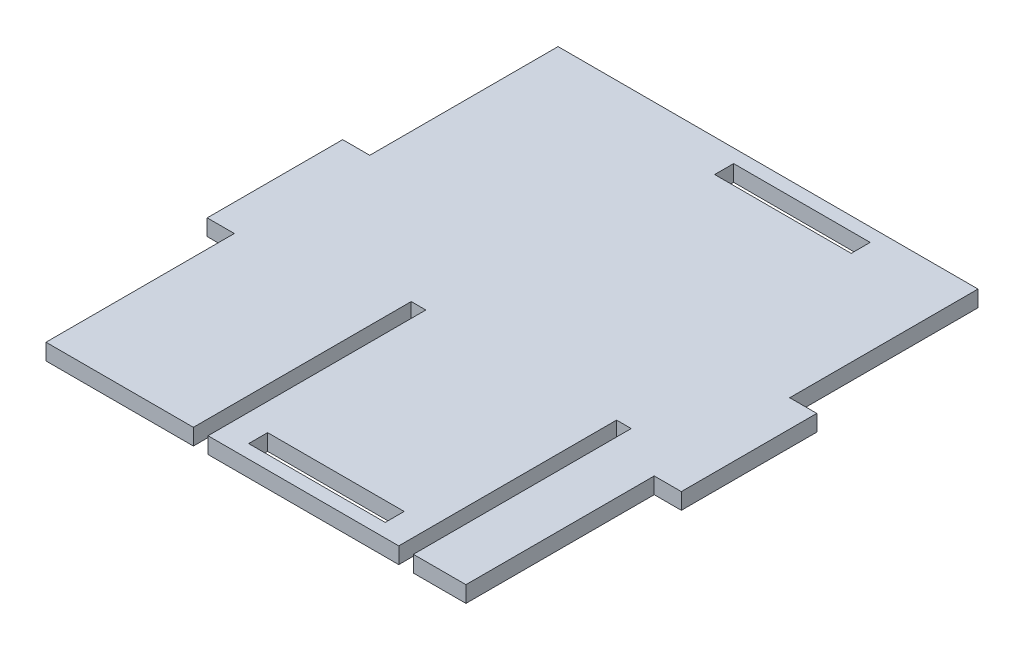
ISO-10303-21;
HEADER;
FILE_DESCRIPTION(('STEP AP214'),'2;1');
FILE_NAME('part.step','',(''),(''),'','','');
FILE_SCHEMA(('AUTOMOTIVE_DESIGN { 1 0 10303 214 1 1 1 1 }'));
ENDSEC;
DATA;
#1=APPLICATION_CONTEXT('core data for automotive mechanical design processes');
#2=APPLICATION_PROTOCOL_DEFINITION('international standard','automotive_design',2000,#1);
#3=PRODUCT_CONTEXT('',#1,'mechanical');
#4=PRODUCT('Part','Part','',(#3));
#5=PRODUCT_RELATED_PRODUCT_CATEGORY('part','',(#4));
#6=PRODUCT_DEFINITION_FORMATION('','',#4);
#7=PRODUCT_DEFINITION_CONTEXT('part definition',#1,'design');
#8=PRODUCT_DEFINITION('design','',#6,#7);
#9=PRODUCT_DEFINITION_SHAPE('','',#8);
#10=(LENGTH_UNIT() NAMED_UNIT(*) SI_UNIT(.MILLI.,.METRE.));
#11=(NAMED_UNIT(*) PLANE_ANGLE_UNIT() SI_UNIT($,.RADIAN.));
#12=(NAMED_UNIT(*) SI_UNIT($,.STERADIAN.) SOLID_ANGLE_UNIT());
#13=UNCERTAINTY_MEASURE_WITH_UNIT(LENGTH_MEASURE(1.E-05),#10,'distance_accuracy_value','');
#14=(GEOMETRIC_REPRESENTATION_CONTEXT(3) GLOBAL_UNCERTAINTY_ASSIGNED_CONTEXT((#13)) GLOBAL_UNIT_ASSIGNED_CONTEXT((#10,
#11,#12)) REPRESENTATION_CONTEXT('',''));
#15=CARTESIAN_POINT('',(0.,0.,0.));
#16=DIRECTION('',(0.,0.,1.));
#17=DIRECTION('',(1.,0.,0.));
#18=AXIS2_PLACEMENT_3D('',#15,#16,#17);
#19=CARTESIAN_POINT('',(-19.4,6.,0.));
#20=DIRECTION('',(-1.,0.,0.));
#21=DIRECTION('',(0.,0.,1.));
#22=AXIS2_PLACEMENT_3D('',#19,#20,#21);
#23=PLANE('',#22);
#24=DIRECTION('',(0.,0.,-1.));
#25=VECTOR('',#24,1.);
#26=CARTESIAN_POINT('',(-19.4,0.,0.));
#27=LINE('',#26,#25);
#28=CARTESIAN_POINT('',(-19.4,0.,0.));
#29=VERTEX_POINT('',#28);
#30=CARTESIAN_POINT('',(-19.4,0.,-80.4));
#31=VERTEX_POINT('',#30);
#32=EDGE_CURVE('E449',#29,#31,#27,.T.);
#33=ORIENTED_EDGE('',*,*,#32,.F.);
#34=DIRECTION('',(0.,-1.,0.));
#35=VECTOR('',#34,1.);
#36=CARTESIAN_POINT('',(-19.4,6.,0.));
#37=LINE('',#36,#35);
#38=CARTESIAN_POINT('',(-19.4,6.,0.));
#39=VERTEX_POINT('',#38);
#40=EDGE_CURVE('E11',#39,#29,#37,.T.);
#41=ORIENTED_EDGE('',*,*,#40,.F.);
#42=DIRECTION('',(0.,0.,-1.));
#43=VECTOR('',#42,1.);
#44=CARTESIAN_POINT('',(-19.4,6.,0.));
#45=LINE('',#44,#43);
#46=CARTESIAN_POINT('',(-19.4,6.,-80.4));
#47=VERTEX_POINT('',#46);
#48=EDGE_CURVE('E283',#39,#47,#45,.T.);
#49=ORIENTED_EDGE('',*,*,#48,.T.);
#50=DIRECTION('',(0.,-1.,0.));
#51=VECTOR('',#50,1.);
#52=CARTESIAN_POINT('',(-19.4,6.,-80.4));
#53=LINE('',#52,#51);
#54=EDGE_CURVE('E162',#47,#31,#53,.T.);
#55=ORIENTED_EDGE('',*,*,#54,.T.);
#56=EDGE_LOOP('',(#33,#41,#49,#55));
#57=FACE_BOUND('',#56,.T.);
#58=ADVANCED_FACE('F47',(#57),#23,.T.);
#59=CARTESIAN_POINT('',(0.,6.,0.));
#60=DIRECTION('',(0.,0.,1.));
#61=DIRECTION('',(1.,0.,0.));
#62=AXIS2_PLACEMENT_3D('',#59,#60,#61);
#63=PLANE('',#62);
#64=DIRECTION('',(-1.,0.,0.));
#65=VECTOR('',#64,1.);
#66=CARTESIAN_POINT('',(0.,0.,0.));
#67=LINE('',#66,#65);
#68=CARTESIAN_POINT('',(0.,0.,0.));
#69=VERTEX_POINT('',#68);
#70=EDGE_CURVE('E452',#69,#29,#67,.T.);
#71=ORIENTED_EDGE('',*,*,#70,.F.);
#72=DIRECTION('',(0.,-1.,0.));
#73=VECTOR('',#72,1.);
#74=CARTESIAN_POINT('',(0.,6.,0.));
#75=LINE('',#74,#73);
#76=CARTESIAN_POINT('',(0.,6.,0.));
#77=VERTEX_POINT('',#76);
#78=EDGE_CURVE('E58',#77,#69,#75,.T.);
#79=ORIENTED_EDGE('',*,*,#78,.F.);
#80=DIRECTION('',(-1.,0.,0.));
#81=VECTOR('',#80,1.);
#82=CARTESIAN_POINT('',(0.,6.,0.));
#83=LINE('',#82,#81);
#84=EDGE_CURVE('E270',#77,#39,#83,.T.);
#85=ORIENTED_EDGE('',*,*,#84,.T.);
#86=ORIENTED_EDGE('',*,*,#40,.T.);
#87=EDGE_LOOP('',(#71,#79,#85,#86));
#88=FACE_BOUND('',#87,.T.);
#89=ADVANCED_FACE('F567',(#88),#63,.T.);
#90=CARTESIAN_POINT('',(0.,6.,0.));
#91=DIRECTION('',(-1.,0.,0.));
#92=DIRECTION('',(0.,0.,1.));
#93=AXIS2_PLACEMENT_3D('',#90,#91,#92);
#94=PLANE('',#93);
#95=DIRECTION('',(0.,0.,-1.));
#96=VECTOR('',#95,1.);
#97=CARTESIAN_POINT('',(0.,0.,0.));
#98=LINE('',#97,#96);
#99=CARTESIAN_POINT('',(0.,0.,-69.5));
#100=VERTEX_POINT('',#99);
#101=EDGE_CURVE('E456',#69,#100,#98,.T.);
#102=ORIENTED_EDGE('',*,*,#101,.T.);
#103=DIRECTION('',(0.,-1.,0.));
#104=VECTOR('',#103,1.);
#105=CARTESIAN_POINT('',(0.,6.,-69.5));
#106=LINE('',#105,#104);
#107=CARTESIAN_POINT('',(0.,6.,-69.5));
#108=VERTEX_POINT('',#107);
#109=EDGE_CURVE('E378',#108,#100,#106,.T.);
#110=ORIENTED_EDGE('',*,*,#109,.F.);
#111=DIRECTION('',(0.,0.,-1.));
#112=VECTOR('',#111,1.);
#113=CARTESIAN_POINT('',(0.,6.,0.));
#114=LINE('',#113,#112);
#115=EDGE_CURVE('E282',#77,#108,#114,.T.);
#116=ORIENTED_EDGE('',*,*,#115,.F.);
#117=ORIENTED_EDGE('',*,*,#78,.T.);
#118=EDGE_LOOP('',(#102,#110,#116,#117));
#119=FACE_BOUND('',#118,.T.);
#120=ADVANCED_FACE('F566',(#119),#94,.F.);
#121=CARTESIAN_POINT('',(0.,6.,-69.5));
#122=DIRECTION('',(0.,0.,-1.));
#123=DIRECTION('',(-1.,0.,0.));
#124=AXIS2_PLACEMENT_3D('',#121,#122,#123);
#125=PLANE('',#124);
#126=DIRECTION('',(1.,0.,0.));
#127=VECTOR('',#126,1.);
#128=CARTESIAN_POINT('',(0.,0.,-69.5));
#129=LINE('',#128,#127);
#130=CARTESIAN_POINT('',(10.,0.,-69.5));
#131=VERTEX_POINT('',#130);
#132=EDGE_CURVE('E461',#100,#131,#129,.T.);
#133=ORIENTED_EDGE('',*,*,#132,.T.);
#134=DIRECTION('',(0.,-1.,0.));
#135=VECTOR('',#134,1.);
#136=CARTESIAN_POINT('',(10.,6.,-69.5));
#137=LINE('',#136,#135);
#138=CARTESIAN_POINT('',(10.,6.,-69.5));
#139=VERTEX_POINT('',#138);
#140=EDGE_CURVE('E374',#139,#131,#137,.T.);
#141=ORIENTED_EDGE('',*,*,#140,.F.);
#142=DIRECTION('',(1.,0.,0.));
#143=VECTOR('',#142,1.);
#144=CARTESIAN_POINT('',(0.,6.,-69.5));
#145=LINE('',#144,#143);
#146=EDGE_CURVE('E289',#108,#139,#145,.T.);
#147=ORIENTED_EDGE('',*,*,#146,.F.);
#148=ORIENTED_EDGE('',*,*,#109,.T.);
#149=EDGE_LOOP('',(#133,#141,#147,#148));
#150=FACE_BOUND('',#149,.T.);
#151=ADVANCED_FACE('F562',(#150),#125,.F.);
#152=CARTESIAN_POINT('',(10.,6.,0.));
#153=DIRECTION('',(-1.,0.,0.));
#154=DIRECTION('',(0.,0.,1.));
#155=AXIS2_PLACEMENT_3D('',#152,#153,#154);
#156=PLANE('',#155);
#157=DIRECTION('',(0.,0.,-1.));
#158=VECTOR('',#157,1.);
#159=CARTESIAN_POINT('',(10.,0.,0.));
#160=LINE('',#159,#158);
#161=CARTESIAN_POINT('',(10.,0.,-119.5));
#162=VERTEX_POINT('',#161);
#163=EDGE_CURVE('E466',#131,#162,#160,.T.);
#164=ORIENTED_EDGE('',*,*,#163,.T.);
#165=DIRECTION('',(0.,-1.,0.));
#166=VECTOR('',#165,1.);
#167=CARTESIAN_POINT('',(10.,6.,-119.5));
#168=LINE('',#167,#166);
#169=CARTESIAN_POINT('',(10.,6.,-119.5));
#170=VERTEX_POINT('',#169);
#171=EDGE_CURVE('E371',#170,#162,#168,.T.);
#172=ORIENTED_EDGE('',*,*,#171,.F.);
#173=DIRECTION('',(0.,0.,-1.));
#174=VECTOR('',#173,1.);
#175=CARTESIAN_POINT('',(10.,6.,0.));
#176=LINE('',#175,#174);
#177=EDGE_CURVE('E568',#139,#170,#176,.T.);
#178=ORIENTED_EDGE('',*,*,#177,.F.);
#179=ORIENTED_EDGE('',*,*,#140,.T.);
#180=EDGE_LOOP('',(#164,#172,#178,#179));
#181=FACE_BOUND('',#180,.T.);
#182=ADVANCED_FACE('F556',(#181),#156,.F.);
#183=CARTESIAN_POINT('',(0.,6.,-119.5));
#184=DIRECTION('',(0.,0.,-1.));
#185=DIRECTION('',(-1.,0.,0.));
#186=AXIS2_PLACEMENT_3D('',#183,#184,#185);
#187=PLANE('',#186);
#188=DIRECTION('',(1.,0.,0.));
#189=VECTOR('',#188,1.);
#190=CARTESIAN_POINT('',(0.,0.,-119.5));
#191=LINE('',#190,#189);
#192=CARTESIAN_POINT('',(0.,0.,-119.5));
#193=VERTEX_POINT('',#192);
#194=EDGE_CURVE('E470',#193,#162,#191,.T.);
#195=ORIENTED_EDGE('',*,*,#194,.F.);
#196=DIRECTION('',(0.,-1.,0.));
#197=VECTOR('',#196,1.);
#198=CARTESIAN_POINT('',(0.,6.,-119.5));
#199=LINE('',#198,#197);
#200=CARTESIAN_POINT('',(0.,6.,-119.5));
#201=VERTEX_POINT('',#200);
#202=EDGE_CURVE('E368',#201,#193,#199,.T.);
#203=ORIENTED_EDGE('',*,*,#202,.F.);
#204=DIRECTION('',(1.,0.,0.));
#205=VECTOR('',#204,1.);
#206=CARTESIAN_POINT('',(0.,6.,-119.5));
#207=LINE('',#206,#205);
#208=EDGE_CURVE('E554',#201,#170,#207,.T.);
#209=ORIENTED_EDGE('',*,*,#208,.T.);
#210=ORIENTED_EDGE('',*,*,#171,.T.);
#211=EDGE_LOOP('',(#195,#203,#209,#210));
#212=FACE_BOUND('',#211,.T.);
#213=ADVANCED_FACE('F549',(#212),#187,.T.);
#214=CARTESIAN_POINT('',(0.,0.,-189.));
#215=VERTEX_POINT('',#214);
#216=EDGE_CURVE('E462',#193,#215,#98,.T.);
#217=ORIENTED_EDGE('',*,*,#216,.T.);
#218=DIRECTION('',(0.,-1.,0.));
#219=VECTOR('',#218,1.);
#220=CARTESIAN_POINT('',(0.,6.,-189.));
#221=LINE('',#220,#219);
#222=CARTESIAN_POINT('',(0.,6.,-189.));
#223=VERTEX_POINT('',#222);
#224=EDGE_CURVE('E364',#223,#215,#221,.T.);
#225=ORIENTED_EDGE('',*,*,#224,.F.);
#226=EDGE_CURVE('E290',#201,#223,#114,.T.);
#227=ORIENTED_EDGE('',*,*,#226,.F.);
#228=ORIENTED_EDGE('',*,*,#202,.T.);
#229=EDGE_LOOP('',(#217,#225,#227,#228));
#230=FACE_BOUND('',#229,.T.);
#231=ADVANCED_FACE('F756',(#230),#94,.F.);
#232=CARTESIAN_POINT('',(0.,6.,-189.));
#233=DIRECTION('',(0.,0.,1.));
#234=DIRECTION('',(1.,0.,0.));
#235=AXIS2_PLACEMENT_3D('',#232,#233,#234);
#236=PLANE('',#235);
#237=DIRECTION('',(-1.,0.,0.));
#238=VECTOR('',#237,1.);
#239=CARTESIAN_POINT('',(0.,0.,-189.));
#240=LINE('',#239,#238);
#241=CARTESIAN_POINT('',(-155.,0.,-189.));
#242=VERTEX_POINT('',#241);
#243=EDGE_CURVE('E474',#215,#242,#240,.T.);
#244=ORIENTED_EDGE('',*,*,#243,.T.);
#245=DIRECTION('',(0.,-1.,0.));
#246=VECTOR('',#245,1.);
#247=CARTESIAN_POINT('',(-155.,6.,-189.));
#248=LINE('',#247,#246);
#249=CARTESIAN_POINT('',(-155.,6.,-189.));
#250=VERTEX_POINT('',#249);
#251=EDGE_CURVE('E361',#250,#242,#248,.T.);
#252=ORIENTED_EDGE('',*,*,#251,.F.);
#253=DIRECTION('',(-1.,0.,0.));
#254=VECTOR('',#253,1.);
#255=CARTESIAN_POINT('',(0.,6.,-189.));
#256=LINE('',#255,#254);
#257=EDGE_CURVE('E576',#223,#250,#256,.T.);
#258=ORIENTED_EDGE('',*,*,#257,.F.);
#259=ORIENTED_EDGE('',*,*,#224,.T.);
#260=EDGE_LOOP('',(#244,#252,#258,#259));
#261=FACE_BOUND('',#260,.T.);
#262=ADVANCED_FACE('F541',(#261),#236,.F.);
#263=CARTESIAN_POINT('',(-155.,6.,0.));
#264=DIRECTION('',(-1.,0.,0.));
#265=DIRECTION('',(0.,0.,1.));
#266=AXIS2_PLACEMENT_3D('',#263,#264,#265);
#267=PLANE('',#266);
#268=DIRECTION('',(0.,0.,-1.));
#269=VECTOR('',#268,1.);
#270=CARTESIAN_POINT('',(-155.,0.,0.));
#271=LINE('',#270,#269);
#272=CARTESIAN_POINT('',(-155.,0.,-119.5));
#273=VERTEX_POINT('',#272);
#274=EDGE_CURVE('E478',#273,#242,#271,.T.);
#275=ORIENTED_EDGE('',*,*,#274,.F.);
#276=DIRECTION('',(0.,-1.,0.));
#277=VECTOR('',#276,1.);
#278=CARTESIAN_POINT('',(-155.,6.,-119.5));
#279=LINE('',#278,#277);
#280=CARTESIAN_POINT('',(-155.,6.,-119.5));
#281=VERTEX_POINT('',#280);
#282=EDGE_CURVE('E358',#281,#273,#279,.T.);
#283=ORIENTED_EDGE('',*,*,#282,.F.);
#284=DIRECTION('',(0.,0.,-1.));
#285=VECTOR('',#284,1.);
#286=CARTESIAN_POINT('',(-155.,6.,0.));
#287=LINE('',#286,#285);
#288=EDGE_CURVE('E539',#281,#250,#287,.T.);
#289=ORIENTED_EDGE('',*,*,#288,.T.);
#290=ORIENTED_EDGE('',*,*,#251,.T.);
#291=EDGE_LOOP('',(#275,#283,#289,#290));
#292=FACE_BOUND('',#291,.T.);
#293=ADVANCED_FACE('F534',(#292),#267,.T.);
#294=CARTESIAN_POINT('',(0.,6.,-119.5));
#295=DIRECTION('',(0.,0.,1.));
#296=DIRECTION('',(1.,0.,0.));
#297=AXIS2_PLACEMENT_3D('',#294,#295,#296);
#298=PLANE('',#297);
#299=DIRECTION('',(-1.,0.,0.));
#300=VECTOR('',#299,1.);
#301=CARTESIAN_POINT('',(0.,0.,-119.5));
#302=LINE('',#301,#300);
#303=CARTESIAN_POINT('',(-165.,0.,-119.5));
#304=VERTEX_POINT('',#303);
#305=EDGE_CURVE('E482',#273,#304,#302,.T.);
#306=ORIENTED_EDGE('',*,*,#305,.T.);
#307=DIRECTION('',(0.,-1.,0.));
#308=VECTOR('',#307,1.);
#309=CARTESIAN_POINT('',(-165.,6.,-119.5));
#310=LINE('',#309,#308);
#311=CARTESIAN_POINT('',(-165.,6.,-119.5));
#312=VERTEX_POINT('',#311);
#313=EDGE_CURVE('E355',#312,#304,#310,.T.);
#314=ORIENTED_EDGE('',*,*,#313,.F.);
#315=DIRECTION('',(-1.,0.,0.));
#316=VECTOR('',#315,1.);
#317=CARTESIAN_POINT('',(0.,6.,-119.5));
#318=LINE('',#317,#316);
#319=EDGE_CURVE('E581',#281,#312,#318,.T.);
#320=ORIENTED_EDGE('',*,*,#319,.F.);
#321=ORIENTED_EDGE('',*,*,#282,.T.);
#322=EDGE_LOOP('',(#306,#314,#320,#321));
#323=FACE_BOUND('',#322,.T.);
#324=ADVANCED_FACE('F729',(#323),#298,.F.);
#325=CARTESIAN_POINT('',(-165.,6.,0.));
#326=DIRECTION('',(-1.,0.,0.));
#327=DIRECTION('',(0.,0.,1.));
#328=AXIS2_PLACEMENT_3D('',#325,#326,#327);
#329=PLANE('',#328);
#330=DIRECTION('',(0.,0.,-1.));
#331=VECTOR('',#330,1.);
#332=CARTESIAN_POINT('',(-165.,0.,0.));
#333=LINE('',#332,#331);
#334=CARTESIAN_POINT('',(-165.,0.,-69.5));
#335=VERTEX_POINT('',#334);
#336=EDGE_CURVE('E487',#335,#304,#333,.T.);
#337=ORIENTED_EDGE('',*,*,#336,.F.);
#338=DIRECTION('',(0.,-1.,0.));
#339=VECTOR('',#338,1.);
#340=CARTESIAN_POINT('',(-165.,6.,-69.5));
#341=LINE('',#340,#339);
#342=CARTESIAN_POINT('',(-165.,6.,-69.5));
#343=VERTEX_POINT('',#342);
#344=EDGE_CURVE('E352',#343,#335,#341,.T.);
#345=ORIENTED_EDGE('',*,*,#344,.F.);
#346=DIRECTION('',(0.,0.,-1.));
#347=VECTOR('',#346,1.);
#348=CARTESIAN_POINT('',(-165.,6.,0.));
#349=LINE('',#348,#347);
#350=EDGE_CURVE('E584',#343,#312,#349,.T.);
#351=ORIENTED_EDGE('',*,*,#350,.T.);
#352=ORIENTED_EDGE('',*,*,#313,.T.);
#353=EDGE_LOOP('',(#337,#345,#351,#352));
#354=FACE_BOUND('',#353,.T.);
#355=ADVANCED_FACE('F528',(#354),#329,.T.);
#356=CARTESIAN_POINT('',(0.,6.,-69.5));
#357=DIRECTION('',(0.,0.,1.));
#358=DIRECTION('',(1.,0.,0.));
#359=AXIS2_PLACEMENT_3D('',#356,#357,#358);
#360=PLANE('',#359);
#361=DIRECTION('',(-1.,0.,0.));
#362=VECTOR('',#361,1.);
#363=CARTESIAN_POINT('',(0.,0.,-69.5));
#364=LINE('',#363,#362);
#365=CARTESIAN_POINT('',(-155.,0.,-69.5));
#366=VERTEX_POINT('',#365);
#367=EDGE_CURVE('E491',#366,#335,#364,.T.);
#368=ORIENTED_EDGE('',*,*,#367,.F.);
#369=DIRECTION('',(0.,-1.,0.));
#370=VECTOR('',#369,1.);
#371=CARTESIAN_POINT('',(-155.,6.,-69.5));
#372=LINE('',#371,#370);
#373=CARTESIAN_POINT('',(-155.,6.,-69.5));
#374=VERTEX_POINT('',#373);
#375=EDGE_CURVE('E349',#374,#366,#372,.T.);
#376=ORIENTED_EDGE('',*,*,#375,.F.);
#377=DIRECTION('',(-1.,0.,0.));
#378=VECTOR('',#377,1.);
#379=CARTESIAN_POINT('',(0.,6.,-69.5));
#380=LINE('',#379,#378);
#381=EDGE_CURVE('E524',#374,#343,#380,.T.);
#382=ORIENTED_EDGE('',*,*,#381,.T.);
#383=ORIENTED_EDGE('',*,*,#344,.T.);
#384=EDGE_LOOP('',(#368,#376,#382,#383));
#385=FACE_BOUND('',#384,.T.);
#386=ADVANCED_FACE('F522',(#385),#360,.T.);
#387=CARTESIAN_POINT('',(-155.,0.,0.));
#388=VERTEX_POINT('',#387);
#389=EDGE_CURVE('E483',#388,#366,#271,.T.);
#390=ORIENTED_EDGE('',*,*,#389,.F.);
#391=DIRECTION('',(0.,-1.,0.));
#392=VECTOR('',#391,1.);
#393=CARTESIAN_POINT('',(-155.,6.,0.));
#394=LINE('',#393,#392);
#395=CARTESIAN_POINT('',(-155.,6.,0.));
#396=VERTEX_POINT('',#395);
#397=EDGE_CURVE('E346',#396,#388,#394,.T.);
#398=ORIENTED_EDGE('',*,*,#397,.F.);
#399=EDGE_CURVE('E279',#396,#374,#287,.T.);
#400=ORIENTED_EDGE('',*,*,#399,.T.);
#401=ORIENTED_EDGE('',*,*,#375,.T.);
#402=EDGE_LOOP('',(#390,#398,#400,#401));
#403=FACE_BOUND('',#402,.T.);
#404=ADVANCED_FACE('F516',(#403),#267,.T.);
#405=CARTESIAN_POINT('',(-100.6,0.,0.));
#406=VERTEX_POINT('',#405);
#407=EDGE_CURVE('E457',#406,#388,#67,.T.);
#408=ORIENTED_EDGE('',*,*,#407,.F.);
#409=DIRECTION('',(0.,-1.,0.));
#410=VECTOR('',#409,1.);
#411=CARTESIAN_POINT('',(-100.6,6.,0.));
#412=LINE('',#411,#410);
#413=CARTESIAN_POINT('',(-100.6,6.,0.));
#414=VERTEX_POINT('',#413);
#415=EDGE_CURVE('E343',#414,#406,#412,.T.);
#416=ORIENTED_EDGE('',*,*,#415,.F.);
#417=EDGE_CURVE('E269',#414,#396,#83,.T.);
#418=ORIENTED_EDGE('',*,*,#417,.T.);
#419=ORIENTED_EDGE('',*,*,#397,.T.);
#420=EDGE_LOOP('',(#408,#416,#418,#419));
#421=FACE_BOUND('',#420,.T.);
#422=ADVANCED_FACE('F608',(#421),#63,.T.);
#423=CARTESIAN_POINT('',(-100.6,6.,0.));
#424=DIRECTION('',(-1.,0.,0.));
#425=DIRECTION('',(0.,0.,1.));
#426=AXIS2_PLACEMENT_3D('',#423,#424,#425);
#427=PLANE('',#426);
#428=DIRECTION('',(0.,0.,-1.));
#429=VECTOR('',#428,1.);
#430=CARTESIAN_POINT('',(-100.6,0.,0.));
#431=LINE('',#430,#429);
#432=CARTESIAN_POINT('',(-100.6,0.,-80.4));
#433=VERTEX_POINT('',#432);
#434=EDGE_CURVE('E495',#406,#433,#431,.T.);
#435=ORIENTED_EDGE('',*,*,#434,.T.);
#436=DIRECTION('',(0.,-1.,0.));
#437=VECTOR('',#436,1.);
#438=CARTESIAN_POINT('',(-100.6,6.,-80.4));
#439=LINE('',#438,#437);
#440=CARTESIAN_POINT('',(-100.6,6.,-80.4));
#441=VERTEX_POINT('',#440);
#442=EDGE_CURVE('E339',#441,#433,#439,.T.);
#443=ORIENTED_EDGE('',*,*,#442,.F.);
#444=DIRECTION('',(0.,0.,-1.));
#445=VECTOR('',#444,1.);
#446=CARTESIAN_POINT('',(-100.6,6.,0.));
#447=LINE('',#446,#445);
#448=EDGE_CURVE('E278',#414,#441,#447,.T.);
#449=ORIENTED_EDGE('',*,*,#448,.F.);
#450=ORIENTED_EDGE('',*,*,#415,.T.);
#451=EDGE_LOOP('',(#435,#443,#449,#450));
#452=FACE_BOUND('',#451,.T.);
#453=ADVANCED_FACE('F609',(#452),#427,.F.);
#454=CARTESIAN_POINT('',(0.,6.,-80.4));
#455=DIRECTION('',(0.,0.,-1.));
#456=DIRECTION('',(-1.,0.,0.));
#457=AXIS2_PLACEMENT_3D('',#454,#455,#456);
#458=PLANE('',#457);
#459=DIRECTION('',(1.,0.,0.));
#460=VECTOR('',#459,1.);
#461=CARTESIAN_POINT('',(0.,0.,-80.4));
#462=LINE('',#461,#460);
#463=CARTESIAN_POINT('',(-95.2,0.,-80.4));
#464=VERTEX_POINT('',#463);
#465=EDGE_CURVE('E499',#433,#464,#462,.T.);
#466=ORIENTED_EDGE('',*,*,#465,.T.);
#467=DIRECTION('',(0.,-1.,0.));
#468=VECTOR('',#467,1.);
#469=CARTESIAN_POINT('',(-95.2,6.,-80.4));
#470=LINE('',#469,#468);
#471=CARTESIAN_POINT('',(-95.2,6.,-80.4));
#472=VERTEX_POINT('',#471);
#473=EDGE_CURVE('E336',#472,#464,#470,.T.);
#474=ORIENTED_EDGE('',*,*,#473,.F.);
#475=DIRECTION('',(1.,0.,0.));
#476=VECTOR('',#475,1.);
#477=CARTESIAN_POINT('',(0.,6.,-80.4));
#478=LINE('',#477,#476);
#479=EDGE_CURVE('E272',#441,#472,#478,.T.);
#480=ORIENTED_EDGE('',*,*,#479,.F.);
#481=ORIENTED_EDGE('',*,*,#442,.T.);
#482=EDGE_LOOP('',(#466,#474,#480,#481));
#483=FACE_BOUND('',#482,.T.);
#484=ADVANCED_FACE('F598',(#483),#458,.F.);
#485=CARTESIAN_POINT('',(-95.2,6.,0.));
#486=DIRECTION('',(-1.,0.,0.));
#487=DIRECTION('',(0.,0.,1.));
#488=AXIS2_PLACEMENT_3D('',#485,#486,#487);
#489=PLANE('',#488);
#490=DIRECTION('',(0.,0.,-1.));
#491=VECTOR('',#490,1.);
#492=CARTESIAN_POINT('',(-95.2,0.,0.));
#493=LINE('',#492,#491);
#494=CARTESIAN_POINT('',(-95.2,0.,0.));
#495=VERTEX_POINT('',#494);
#496=EDGE_CURVE('E502',#495,#464,#493,.T.);
#497=ORIENTED_EDGE('',*,*,#496,.F.);
#498=DIRECTION('',(0.,-1.,0.));
#499=VECTOR('',#498,1.);
#500=CARTESIAN_POINT('',(-95.2,6.,0.));
#501=LINE('',#500,#499);
#502=CARTESIAN_POINT('',(-95.2,6.,0.));
#503=VERTEX_POINT('',#502);
#504=EDGE_CURVE('E255',#503,#495,#501,.T.);
#505=ORIENTED_EDGE('',*,*,#504,.F.);
#506=DIRECTION('',(0.,0.,-1.));
#507=VECTOR('',#506,1.);
#508=CARTESIAN_POINT('',(-95.2,6.,0.));
#509=LINE('',#508,#507);
#510=EDGE_CURVE('E266',#503,#472,#509,.T.);
#511=ORIENTED_EDGE('',*,*,#510,.T.);
#512=ORIENTED_EDGE('',*,*,#473,.T.);
#513=EDGE_LOOP('',(#497,#505,#511,#512));
#514=FACE_BOUND('',#513,.T.);
#515=ADVANCED_FACE('F600',(#514),#489,.T.);
#516=CARTESIAN_POINT('',(-24.8,0.,0.));
#517=VERTEX_POINT('',#516);
#518=EDGE_CURVE('E251',#517,#495,#67,.T.);
#519=ORIENTED_EDGE('',*,*,#518,.F.);
#520=DIRECTION('',(0.,-1.,0.));
#521=VECTOR('',#520,1.);
#522=CARTESIAN_POINT('',(-24.8,6.,0.));
#523=LINE('',#522,#521);
#524=CARTESIAN_POINT('',(-24.8,6.,0.));
#525=VERTEX_POINT('',#524);
#526=EDGE_CURVE('E245',#525,#517,#523,.T.);
#527=ORIENTED_EDGE('',*,*,#526,.F.);
#528=EDGE_CURVE('E249',#525,#503,#83,.T.);
#529=ORIENTED_EDGE('',*,*,#528,.T.);
#530=ORIENTED_EDGE('',*,*,#504,.T.);
#531=EDGE_LOOP('',(#519,#527,#529,#530));
#532=FACE_BOUND('',#531,.T.);
#533=ADVANCED_FACE('F247',(#532),#63,.T.);
#534=CARTESIAN_POINT('',(-24.8,6.,0.));
#535=DIRECTION('',(-1.,0.,0.));
#536=DIRECTION('',(0.,0.,1.));
#537=AXIS2_PLACEMENT_3D('',#534,#535,#536);
#538=PLANE('',#537);
#539=DIRECTION('',(0.,0.,-1.));
#540=VECTOR('',#539,1.);
#541=CARTESIAN_POINT('',(-24.8,0.,0.));
#542=LINE('',#541,#540);
#543=CARTESIAN_POINT('',(-24.8,0.,-80.4));
#544=VERTEX_POINT('',#543);
#545=EDGE_CURVE('E322',#517,#544,#542,.T.);
#546=ORIENTED_EDGE('',*,*,#545,.T.);
#547=DIRECTION('',(0.,-1.,0.));
#548=VECTOR('',#547,1.);
#549=CARTESIAN_POINT('',(-24.8,6.,-80.4));
#550=LINE('',#549,#548);
#551=CARTESIAN_POINT('',(-24.8,6.,-80.4));
#552=VERTEX_POINT('',#551);
#553=EDGE_CURVE('E256',#552,#544,#550,.T.);
#554=ORIENTED_EDGE('',*,*,#553,.F.);
#555=DIRECTION('',(0.,0.,-1.));
#556=VECTOR('',#555,1.);
#557=CARTESIAN_POINT('',(-24.8,6.,0.));
#558=LINE('',#557,#556);
#559=EDGE_CURVE('E259',#525,#552,#558,.T.);
#560=ORIENTED_EDGE('',*,*,#559,.F.);
#561=ORIENTED_EDGE('',*,*,#526,.T.);
#562=EDGE_LOOP('',(#546,#554,#560,#561));
#563=FACE_BOUND('',#562,.T.);
#564=ADVANCED_FACE('F260',(#563),#538,.F.);
#565=CARTESIAN_POINT('',(-34.8,6.,0.));
#566=DIRECTION('',(-1.,0.,0.));
#567=DIRECTION('',(0.,0.,1.));
#568=AXIS2_PLACEMENT_3D('',#565,#566,#567);
#569=PLANE('',#568);
#570=DIRECTION('',(0.,0.,-1.));
#571=VECTOR('',#570,1.);
#572=CARTESIAN_POINT('',(-34.8,0.,0.));
#573=LINE('',#572,#571);
#574=CARTESIAN_POINT('',(-34.8,0.,-4.99999999999999));
#575=VERTEX_POINT('',#574);
#576=CARTESIAN_POINT('',(-34.8,0.,-12.));
#577=VERTEX_POINT('',#576);
#578=EDGE_CURVE('E433',#575,#577,#573,.T.);
#579=ORIENTED_EDGE('',*,*,#578,.F.);
#580=DIRECTION('',(0.,-1.,0.));
#581=VECTOR('',#580,1.);
#582=CARTESIAN_POINT('',(-34.8,6.,-4.99999999999999));
#583=LINE('',#582,#581);
#584=CARTESIAN_POINT('',(-34.8,6.,-4.99999999999999));
#585=VERTEX_POINT('',#584);
#586=EDGE_CURVE('E331',#585,#575,#583,.T.);
#587=ORIENTED_EDGE('',*,*,#586,.F.);
#588=DIRECTION('',(0.,0.,-1.));
#589=VECTOR('',#588,1.);
#590=CARTESIAN_POINT('',(-34.8,6.,0.));
#591=LINE('',#590,#589);
#592=CARTESIAN_POINT('',(-34.8,6.,-12.));
#593=VERTEX_POINT('',#592);
#594=EDGE_CURVE('E303',#585,#593,#591,.T.);
#595=ORIENTED_EDGE('',*,*,#594,.T.);
#596=DIRECTION('',(0.,-1.,0.));
#597=VECTOR('',#596,1.);
#598=CARTESIAN_POINT('',(-34.8,6.,-12.));
#599=LINE('',#598,#597);
#600=EDGE_CURVE('E384',#593,#577,#599,.T.);
#601=ORIENTED_EDGE('',*,*,#600,.T.);
#602=EDGE_LOOP('',(#579,#587,#595,#601));
#603=FACE_BOUND('',#602,.T.);
#604=ADVANCED_FACE('F632',(#603),#569,.T.);
#605=CARTESIAN_POINT('',(0.,6.,-4.99999999999998));
#606=DIRECTION('',(0.,0.,-1.));
#607=DIRECTION('',(-1.,0.,0.));
#608=AXIS2_PLACEMENT_3D('',#605,#606,#607);
#609=PLANE('',#608);
#610=DIRECTION('',(1.,0.,0.));
#611=VECTOR('',#610,1.);
#612=CARTESIAN_POINT('',(0.,0.,-4.99999999999998));
#613=LINE('',#612,#611);
#614=CARTESIAN_POINT('',(-85.2,0.,-4.99999999999999));
#615=VERTEX_POINT('',#614);
#616=EDGE_CURVE('E437',#615,#575,#613,.T.);
#617=ORIENTED_EDGE('',*,*,#616,.F.);
#618=DIRECTION('',(0.,-1.,0.));
#619=VECTOR('',#618,1.);
#620=CARTESIAN_POINT('',(-85.2,6.,-4.99999999999999));
#621=LINE('',#620,#619);
#622=CARTESIAN_POINT('',(-85.2,6.,-4.99999999999999));
#623=VERTEX_POINT('',#622);
#624=EDGE_CURVE('E391',#623,#615,#621,.T.);
#625=ORIENTED_EDGE('',*,*,#624,.F.);
#626=DIRECTION('',(1.,0.,0.));
#627=VECTOR('',#626,1.);
#628=CARTESIAN_POINT('',(0.,6.,-4.99999999999998));
#629=LINE('',#628,#627);
#630=EDGE_CURVE('E299',#623,#585,#629,.T.);
#631=ORIENTED_EDGE('',*,*,#630,.T.);
#632=ORIENTED_EDGE('',*,*,#586,.T.);
#633=EDGE_LOOP('',(#617,#625,#631,#632));
#634=FACE_BOUND('',#633,.T.);
#635=ADVANCED_FACE('F628',(#634),#609,.T.);
#636=CARTESIAN_POINT('',(-85.1999999999999,6.,5.06737509096768E-13));
#637=DIRECTION('',(-1.,0.,0.));
#638=DIRECTION('',(0.,0.,1.));
#639=AXIS2_PLACEMENT_3D('',#636,#637,#638);
#640=PLANE('',#639);
#641=DIRECTION('',(0.,0.,-1.));
#642=VECTOR('',#641,1.);
#643=CARTESIAN_POINT('',(-85.1999999999999,0.,5.06737509096768E-13));
#644=LINE('',#643,#642);
#645=CARTESIAN_POINT('',(-85.2,0.,-12.));
#646=VERTEX_POINT('',#645);
#647=EDGE_CURVE('E441',#615,#646,#644,.T.);
#648=ORIENTED_EDGE('',*,*,#647,.T.);
#649=DIRECTION('',(0.,-1.,0.));
#650=VECTOR('',#649,1.);
#651=CARTESIAN_POINT('',(-85.2,6.,-12.));
#652=LINE('',#651,#650);
#653=CARTESIAN_POINT('',(-85.2,6.,-12.));
#654=VERTEX_POINT('',#653);
#655=EDGE_CURVE('E387',#654,#646,#652,.T.);
#656=ORIENTED_EDGE('',*,*,#655,.F.);
#657=DIRECTION('',(0.,0.,-1.));
#658=VECTOR('',#657,1.);
#659=CARTESIAN_POINT('',(-85.1999999999999,6.,5.06737509096768E-13));
#660=LINE('',#659,#658);
#661=EDGE_CURVE('E293',#623,#654,#660,.T.);
#662=ORIENTED_EDGE('',*,*,#661,.F.);
#663=ORIENTED_EDGE('',*,*,#624,.T.);
#664=EDGE_LOOP('',(#648,#656,#662,#663));
#665=FACE_BOUND('',#664,.T.);
#666=ADVANCED_FACE('F625',(#665),#640,.F.);
#667=CARTESIAN_POINT('',(-85.2000000000007,6.,-3.37825006064515E-13));
#668=DIRECTION('',(1.,0.,0.));
#669=DIRECTION('',(0.,0.,-1.));
#670=AXIS2_PLACEMENT_3D('',#667,#668,#669);
#671=PLANE('',#670);
#672=DIRECTION('',(0.,0.,1.));
#673=VECTOR('',#672,1.);
#674=CARTESIAN_POINT('',(-85.2000000000007,0.,-3.37825006064515E-13));
#675=LINE('',#674,#673);
#676=CARTESIAN_POINT('',(-85.2,0.,-184.));
#677=VERTEX_POINT('',#676);
#678=CARTESIAN_POINT('',(-85.2,0.,-177.));
#679=VERTEX_POINT('',#678);
#680=EDGE_CURVE('E419',#677,#679,#675,.T.);
#681=ORIENTED_EDGE('',*,*,#680,.F.);
#682=DIRECTION('',(0.,-1.,0.));
#683=VECTOR('',#682,1.);
#684=CARTESIAN_POINT('',(-85.2,6.,-184.));
#685=LINE('',#684,#683);
#686=CARTESIAN_POINT('',(-85.2,6.,-184.));
#687=VERTEX_POINT('',#686);
#688=EDGE_CURVE('E51',#687,#677,#685,.T.);
#689=ORIENTED_EDGE('',*,*,#688,.F.);
#690=DIRECTION('',(0.,0.,1.));
#691=VECTOR('',#690,1.);
#692=CARTESIAN_POINT('',(-85.2000000000007,6.,-3.37825006064515E-13));
#693=LINE('',#692,#691);
#694=CARTESIAN_POINT('',(-85.2,6.,-177.));
#695=VERTEX_POINT('',#694);
#696=EDGE_CURVE('E317',#687,#695,#693,.T.);
#697=ORIENTED_EDGE('',*,*,#696,.T.);
#698=DIRECTION('',(0.,-1.,0.));
#699=VECTOR('',#698,1.);
#700=CARTESIAN_POINT('',(-85.2,6.,-177.));
#701=LINE('',#700,#699);
#702=EDGE_CURVE('E396',#695,#679,#701,.T.);
#703=ORIENTED_EDGE('',*,*,#702,.T.);
#704=EDGE_LOOP('',(#681,#689,#697,#703));
#705=FACE_BOUND('',#704,.T.);
#706=ADVANCED_FACE('F49',(#705),#671,.T.);
#707=CARTESIAN_POINT('',(0.,6.,-184.));
#708=DIRECTION('',(0.,0.,-1.));
#709=DIRECTION('',(-1.,0.,0.));
#710=AXIS2_PLACEMENT_3D('',#707,#708,#709);
#711=PLANE('',#710);
#712=DIRECTION('',(1.,0.,0.));
#713=VECTOR('',#712,1.);
#714=CARTESIAN_POINT('',(0.,0.,-184.));
#715=LINE('',#714,#713);
#716=CARTESIAN_POINT('',(-34.8,0.,-184.));
#717=VERTEX_POINT('',#716);
#718=EDGE_CURVE('E413',#677,#717,#715,.T.);
#719=ORIENTED_EDGE('',*,*,#718,.T.);
#720=DIRECTION('',(0.,-1.,0.));
#721=VECTOR('',#720,1.);
#722=CARTESIAN_POINT('',(-34.8,6.,-184.));
#723=LINE('',#722,#721);
#724=CARTESIAN_POINT('',(-34.8,6.,-184.));
#725=VERTEX_POINT('',#724);
#726=EDGE_CURVE('E401',#725,#717,#723,.T.);
#727=ORIENTED_EDGE('',*,*,#726,.F.);
#728=DIRECTION('',(1.,0.,0.));
#729=VECTOR('',#728,1.);
#730=CARTESIAN_POINT('',(0.,6.,-184.));
#731=LINE('',#730,#729);
#732=EDGE_CURVE('E314',#687,#725,#731,.T.);
#733=ORIENTED_EDGE('',*,*,#732,.F.);
#734=ORIENTED_EDGE('',*,*,#688,.T.);
#735=EDGE_LOOP('',(#719,#727,#733,#734));
#736=FACE_BOUND('',#735,.T.);
#737=ADVANCED_FACE('F412',(#736),#711,.F.);
#738=CARTESIAN_POINT('',(-34.7999999999996,6.,0.));
#739=DIRECTION('',(1.,0.,0.));
#740=DIRECTION('',(0.,0.,-1.));
#741=AXIS2_PLACEMENT_3D('',#738,#739,#740);
#742=PLANE('',#741);
#743=DIRECTION('',(0.,0.,1.));
#744=VECTOR('',#743,1.);
#745=CARTESIAN_POINT('',(-34.7999999999996,0.,0.));
#746=LINE('',#745,#744);
#747=CARTESIAN_POINT('',(-34.8,0.,-177.));
#748=VERTEX_POINT('',#747);
#749=EDGE_CURVE('E421',#717,#748,#746,.T.);
#750=ORIENTED_EDGE('',*,*,#749,.T.);
#751=DIRECTION('',(0.,-1.,0.));
#752=VECTOR('',#751,1.);
#753=CARTESIAN_POINT('',(-34.8,6.,-177.));
#754=LINE('',#753,#752);
#755=CARTESIAN_POINT('',(-34.8,6.,-177.));
#756=VERTEX_POINT('',#755);
#757=EDGE_CURVE('E399',#756,#748,#754,.T.);
#758=ORIENTED_EDGE('',*,*,#757,.F.);
#759=DIRECTION('',(0.,0.,1.));
#760=VECTOR('',#759,1.);
#761=CARTESIAN_POINT('',(-34.7999999999996,6.,0.));
#762=LINE('',#761,#760);
#763=EDGE_CURVE('E311',#725,#756,#762,.T.);
#764=ORIENTED_EDGE('',*,*,#763,.F.);
#765=ORIENTED_EDGE('',*,*,#726,.T.);
#766=EDGE_LOOP('',(#750,#758,#764,#765));
#767=FACE_BOUND('',#766,.T.);
#768=ADVANCED_FACE('F623',(#767),#742,.F.);
#769=CARTESIAN_POINT('',(0.,6.,-12.));
#770=DIRECTION('',(0.,0.,-1.));
#771=DIRECTION('',(-1.,0.,0.));
#772=AXIS2_PLACEMENT_3D('',#769,#770,#771);
#773=PLANE('',#772);
#774=DIRECTION('',(1.,0.,0.));
#775=VECTOR('',#774,1.);
#776=CARTESIAN_POINT('',(0.,0.,-12.));
#777=LINE('',#776,#775);
#778=EDGE_CURVE('E445',#646,#577,#777,.T.);
#779=ORIENTED_EDGE('',*,*,#778,.T.);
#780=ORIENTED_EDGE('',*,*,#600,.F.);
#781=DIRECTION('',(1.,0.,0.));
#782=VECTOR('',#781,1.);
#783=CARTESIAN_POINT('',(0.,6.,-12.));
#784=LINE('',#783,#782);
#785=EDGE_CURVE('E291',#654,#593,#784,.T.);
#786=ORIENTED_EDGE('',*,*,#785,.F.);
#787=ORIENTED_EDGE('',*,*,#655,.T.);
#788=EDGE_LOOP('',(#779,#780,#786,#787));
#789=FACE_BOUND('',#788,.T.);
#790=ADVANCED_FACE('F619',(#789),#773,.F.);
#791=CARTESIAN_POINT('',(0.,6.,-177.));
#792=DIRECTION('',(0.,0.,-1.));
#793=DIRECTION('',(-1.,0.,0.));
#794=AXIS2_PLACEMENT_3D('',#791,#792,#793);
#795=PLANE('',#794);
#796=DIRECTION('',(1.,0.,0.));
#797=VECTOR('',#796,1.);
#798=CARTESIAN_POINT('',(0.,0.,-177.));
#799=LINE('',#798,#797);
#800=EDGE_CURVE('E430',#679,#748,#799,.T.);
#801=ORIENTED_EDGE('',*,*,#800,.F.);
#802=ORIENTED_EDGE('',*,*,#702,.F.);
#803=DIRECTION('',(1.,0.,0.));
#804=VECTOR('',#803,1.);
#805=CARTESIAN_POINT('',(0.,6.,-177.));
#806=LINE('',#805,#804);
#807=EDGE_CURVE('E307',#695,#756,#806,.T.);
#808=ORIENTED_EDGE('',*,*,#807,.T.);
#809=ORIENTED_EDGE('',*,*,#757,.T.);
#810=EDGE_LOOP('',(#801,#802,#808,#809));
#811=FACE_BOUND('',#810,.T.);
#812=ADVANCED_FACE('F622',(#811),#795,.T.);
#813=CARTESIAN_POINT('',(-4.13249681388253E-13,6.,-80.4000000000001));
#814=DIRECTION('',(0.,0.,-1.));
#815=DIRECTION('',(-1.,0.,0.));
#816=AXIS2_PLACEMENT_3D('',#813,#814,#815);
#817=PLANE('',#816);
#818=DIRECTION('',(1.,0.,0.));
#819=VECTOR('',#818,1.);
#820=CARTESIAN_POINT('',(-4.13249681388253E-13,0.,-80.4000000000001));
#821=LINE('',#820,#819);
#822=EDGE_CURVE('E155',#544,#31,#821,.T.);
#823=ORIENTED_EDGE('',*,*,#822,.T.);
#824=ORIENTED_EDGE('',*,*,#54,.F.);
#825=DIRECTION('',(1.,0.,0.));
#826=VECTOR('',#825,1.);
#827=CARTESIAN_POINT('',(-4.13249681388253E-13,6.,-80.4000000000001));
#828=LINE('',#827,#826);
#829=EDGE_CURVE('E67',#552,#47,#828,.T.);
#830=ORIENTED_EDGE('',*,*,#829,.F.);
#831=ORIENTED_EDGE('',*,*,#553,.T.);
#832=EDGE_LOOP('',(#823,#824,#830,#831));
#833=FACE_BOUND('',#832,.T.);
#834=ADVANCED_FACE('F639',(#833),#817,.F.);
#835=CARTESIAN_POINT('',(0.,6.,0.));
#836=DIRECTION('',(0.,1.,0.));
#837=DIRECTION('',(0.,0.,1.));
#838=AXIS2_PLACEMENT_3D('',#835,#836,#837);
#839=PLANE('',#838);
#840=ORIENTED_EDGE('',*,*,#696,.F.);
#841=ORIENTED_EDGE('',*,*,#732,.T.);
#842=ORIENTED_EDGE('',*,*,#763,.T.);
#843=ORIENTED_EDGE('',*,*,#807,.F.);
#844=EDGE_LOOP('',(#840,#841,#842,#843));
#845=FACE_BOUND('',#844,.T.);
#846=ORIENTED_EDGE('',*,*,#594,.F.);
#847=ORIENTED_EDGE('',*,*,#630,.F.);
#848=ORIENTED_EDGE('',*,*,#661,.T.);
#849=ORIENTED_EDGE('',*,*,#785,.T.);
#850=EDGE_LOOP('',(#846,#847,#848,#849));
#851=FACE_BOUND('',#850,.T.);
#852=ORIENTED_EDGE('',*,*,#48,.F.);
#853=ORIENTED_EDGE('',*,*,#84,.F.);
#854=ORIENTED_EDGE('',*,*,#115,.T.);
#855=ORIENTED_EDGE('',*,*,#146,.T.);
#856=ORIENTED_EDGE('',*,*,#177,.T.);
#857=ORIENTED_EDGE('',*,*,#208,.F.);
#858=ORIENTED_EDGE('',*,*,#226,.T.);
#859=ORIENTED_EDGE('',*,*,#257,.T.);
#860=ORIENTED_EDGE('',*,*,#288,.F.);
#861=ORIENTED_EDGE('',*,*,#319,.T.);
#862=ORIENTED_EDGE('',*,*,#350,.F.);
#863=ORIENTED_EDGE('',*,*,#381,.F.);
#864=ORIENTED_EDGE('',*,*,#399,.F.);
#865=ORIENTED_EDGE('',*,*,#417,.F.);
#866=ORIENTED_EDGE('',*,*,#448,.T.);
#867=ORIENTED_EDGE('',*,*,#479,.T.);
#868=ORIENTED_EDGE('',*,*,#510,.F.);
#869=ORIENTED_EDGE('',*,*,#528,.F.);
#870=ORIENTED_EDGE('',*,*,#559,.T.);
#871=ORIENTED_EDGE('',*,*,#829,.T.);
#872=EDGE_LOOP('',(#852,#853,#854,#855,#856,#857,#858,#859,#860,#861,#862,#863,#864,#865,#866,
#867,#868,#869,#870,#871));
#873=FACE_BOUND('',#872,.T.);
#874=ADVANCED_FACE('F264',(#845,#851,#873),#839,.T.);
#875=CARTESIAN_POINT('',(0.,0.,0.));
#876=DIRECTION('',(0.,1.,0.));
#877=DIRECTION('',(0.,0.,1.));
#878=AXIS2_PLACEMENT_3D('',#875,#876,#877);
#879=PLANE('',#878);
#880=ORIENTED_EDGE('',*,*,#680,.T.);
#881=ORIENTED_EDGE('',*,*,#800,.T.);
#882=ORIENTED_EDGE('',*,*,#749,.F.);
#883=ORIENTED_EDGE('',*,*,#718,.F.);
#884=EDGE_LOOP('',(#880,#881,#882,#883));
#885=FACE_BOUND('',#884,.T.);
#886=ORIENTED_EDGE('',*,*,#578,.T.);
#887=ORIENTED_EDGE('',*,*,#778,.F.);
#888=ORIENTED_EDGE('',*,*,#647,.F.);
#889=ORIENTED_EDGE('',*,*,#616,.T.);
#890=EDGE_LOOP('',(#886,#887,#888,#889));
#891=FACE_BOUND('',#890,.T.);
#892=ORIENTED_EDGE('',*,*,#32,.T.);
#893=ORIENTED_EDGE('',*,*,#822,.F.);
#894=ORIENTED_EDGE('',*,*,#545,.F.);
#895=ORIENTED_EDGE('',*,*,#518,.T.);
#896=ORIENTED_EDGE('',*,*,#496,.T.);
#897=ORIENTED_EDGE('',*,*,#465,.F.);
#898=ORIENTED_EDGE('',*,*,#434,.F.);
#899=ORIENTED_EDGE('',*,*,#407,.T.);
#900=ORIENTED_EDGE('',*,*,#389,.T.);
#901=ORIENTED_EDGE('',*,*,#367,.T.);
#902=ORIENTED_EDGE('',*,*,#336,.T.);
#903=ORIENTED_EDGE('',*,*,#305,.F.);
#904=ORIENTED_EDGE('',*,*,#274,.T.);
#905=ORIENTED_EDGE('',*,*,#243,.F.);
#906=ORIENTED_EDGE('',*,*,#216,.F.);
#907=ORIENTED_EDGE('',*,*,#194,.T.);
#908=ORIENTED_EDGE('',*,*,#163,.F.);
#909=ORIENTED_EDGE('',*,*,#132,.F.);
#910=ORIENTED_EDGE('',*,*,#101,.F.);
#911=ORIENTED_EDGE('',*,*,#70,.T.);
#912=EDGE_LOOP('',(#892,#893,#894,#895,#896,#897,#898,#899,#900,#901,#902,#903,#904,#905,#906,
#907,#908,#909,#910,#911));
#913=FACE_BOUND('',#912,.T.);
#914=ADVANCED_FACE('F416',(#885,#891,#913),#879,.F.);
#915=CLOSED_SHELL('',(#58,#89,#120,#151,#182,#213,#231,#262,#293,#324,#355,#386,#404,#422,#453,
#484,#515,#533,#564,#604,#635,#666,#706,#737,#768,#790,#812,#834,#874,#914));
#916=MANIFOLD_SOLID_BREP('B2',#915);
#917=ADVANCED_BREP_SHAPE_REPRESENTATION('',(#18,#916),#14);
#918=SHAPE_DEFINITION_REPRESENTATION(#9,#917);
ENDSEC;
END-ISO-10303-21;
